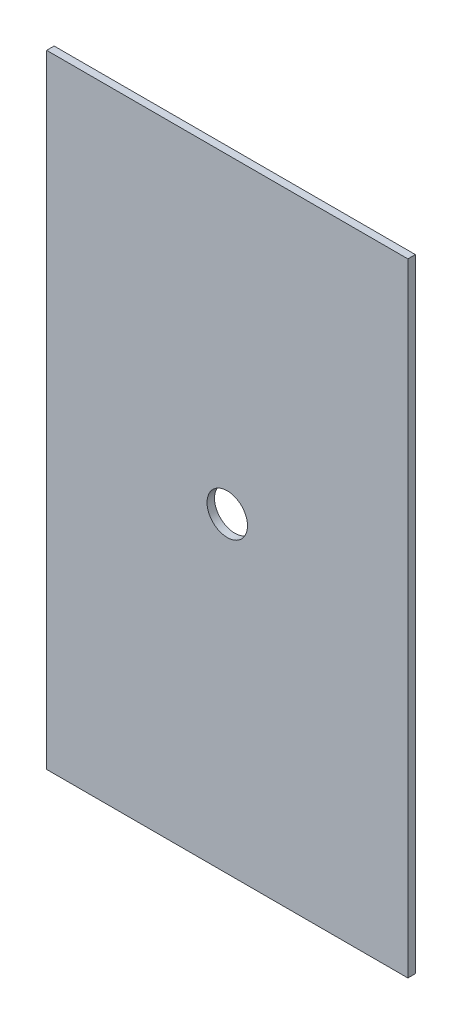
ISO-10303-21;
HEADER;
FILE_DESCRIPTION(('STEP AP214'),'2;1');
FILE_NAME('part.step','',(''),(''),'','','');
FILE_SCHEMA(('AUTOMOTIVE_DESIGN { 1 0 10303 214 1 1 1 1 }'));
ENDSEC;
DATA;
#1=APPLICATION_CONTEXT('core data for automotive mechanical design processes');
#2=APPLICATION_PROTOCOL_DEFINITION('international standard','automotive_design',2000,#1);
#3=PRODUCT_CONTEXT('',#1,'mechanical');
#4=PRODUCT('Part','Part','',(#3));
#5=PRODUCT_RELATED_PRODUCT_CATEGORY('part','',(#4));
#6=PRODUCT_DEFINITION_FORMATION('','',#4);
#7=PRODUCT_DEFINITION_CONTEXT('part definition',#1,'design');
#8=PRODUCT_DEFINITION('design','',#6,#7);
#9=PRODUCT_DEFINITION_SHAPE('','',#8);
#10=(LENGTH_UNIT() NAMED_UNIT(*) SI_UNIT(.MILLI.,.METRE.));
#11=(NAMED_UNIT(*) PLANE_ANGLE_UNIT() SI_UNIT($,.RADIAN.));
#12=(NAMED_UNIT(*) SI_UNIT($,.STERADIAN.) SOLID_ANGLE_UNIT());
#13=UNCERTAINTY_MEASURE_WITH_UNIT(LENGTH_MEASURE(1.E-05),#10,'distance_accuracy_value','');
#14=(GEOMETRIC_REPRESENTATION_CONTEXT(3) GLOBAL_UNCERTAINTY_ASSIGNED_CONTEXT((#13)) GLOBAL_UNIT_ASSIGNED_CONTEXT((#10,
#11,#12)) REPRESENTATION_CONTEXT('',''));
#15=CARTESIAN_POINT('',(0.,0.,0.));
#16=DIRECTION('',(0.,0.,1.));
#17=DIRECTION('',(1.,0.,0.));
#18=AXIS2_PLACEMENT_3D('',#15,#16,#17);
#19=CARTESIAN_POINT('',(-28.9999999999998,50.0000000000005,-1.20000000000053));
#20=DIRECTION('',(-0.999999999999999,0.,0.));
#21=DIRECTION('',(0.,-0.999999999999995,0.));
#22=AXIS2_PLACEMENT_3D('',#19,#20,#21);
#23=PLANE('',#22);
#24=DIRECTION('',(0.,-0.999999999999995,0.));
#25=VECTOR('',#24,1.);
#26=CARTESIAN_POINT('',(-28.9999999999998,50.000000000003,-9.29811783123569E-13));
#27=LINE('',#26,#25);
#28=CARTESIAN_POINT('',(-28.9999999999998,50.000000000003,-9.29811783123569E-13));
#29=VERTEX_POINT('',#28);
#30=CARTESIAN_POINT('',(-29.,-50.0000000000009,7.7715611723761E-13));
#31=VERTEX_POINT('',#30);
#32=EDGE_CURVE('E107',#29,#31,#27,.T.);
#33=ORIENTED_EDGE('',*,*,#32,.F.);
#34=DIRECTION('',(0.,0.,1.00000000000001));
#35=VECTOR('',#34,1.);
#36=CARTESIAN_POINT('',(-28.9999999999998,50.0000000000005,-1.20000000000053));
#37=LINE('',#36,#35);
#38=CARTESIAN_POINT('',(-28.9999999999998,50.0000000000005,-1.20000000000053));
#39=VERTEX_POINT('',#38);
#40=EDGE_CURVE('E12',#39,#29,#37,.T.);
#41=ORIENTED_EDGE('',*,*,#40,.F.);
#42=DIRECTION('',(0.,-0.999999999999995,0.));
#43=VECTOR('',#42,1.);
#44=CARTESIAN_POINT('',(-28.9999999999998,50.0000000000005,-1.20000000000053));
#45=LINE('',#44,#43);
#46=CARTESIAN_POINT('',(-29.0000000000002,-49.9999999999963,-1.1999999999992));
#47=VERTEX_POINT('',#46);
#48=EDGE_CURVE('E99',#39,#47,#45,.T.);
#49=ORIENTED_EDGE('',*,*,#48,.T.);
#50=DIRECTION('',(0.,0.,1.00000000000001));
#51=VECTOR('',#50,1.);
#52=CARTESIAN_POINT('',(-29.0000000000002,-49.9999999999963,-1.1999999999992));
#53=LINE('',#52,#51);
#54=EDGE_CURVE('E44',#47,#31,#53,.T.);
#55=ORIENTED_EDGE('',*,*,#54,.T.);
#56=EDGE_LOOP('',(#33,#41,#49,#55));
#57=FACE_BOUND('',#56,.T.);
#58=ADVANCED_FACE('F41',(#57),#23,.T.);
#59=CARTESIAN_POINT('',(29.0000000000001,49.9999999999996,-1.20000000000026));
#60=DIRECTION('',(0.,0.999999999999994,0.));
#61=DIRECTION('',(0.,0.,1.00000000000001));
#62=AXIS2_PLACEMENT_3D('',#59,#60,#61);
#63=PLANE('',#62);
#64=DIRECTION('',(-0.999999999999999,0.,0.));
#65=VECTOR('',#64,1.);
#66=CARTESIAN_POINT('',(29.0000000000002,50.0000000000032,1.66533453693773E-13));
#67=LINE('',#66,#65);
#68=CARTESIAN_POINT('',(29.0000000000002,50.0000000000032,1.66533453693773E-13));
#69=VERTEX_POINT('',#68);
#70=EDGE_CURVE('E101',#69,#29,#67,.T.);
#71=ORIENTED_EDGE('',*,*,#70,.F.);
#72=DIRECTION('',(0.,0.,1.00000000000001));
#73=VECTOR('',#72,1.);
#74=CARTESIAN_POINT('',(29.0000000000001,49.9999999999996,-1.20000000000026));
#75=LINE('',#74,#73);
#76=CARTESIAN_POINT('',(29.0000000000001,49.9999999999996,-1.20000000000026));
#77=VERTEX_POINT('',#76);
#78=EDGE_CURVE('E50',#77,#69,#75,.T.);
#79=ORIENTED_EDGE('',*,*,#78,.F.);
#80=DIRECTION('',(-0.999999999999999,0.,0.));
#81=VECTOR('',#80,1.);
#82=CARTESIAN_POINT('',(29.0000000000001,49.9999999999996,-1.20000000000026));
#83=LINE('',#82,#81);
#84=EDGE_CURVE('E96',#77,#39,#83,.T.);
#85=ORIENTED_EDGE('',*,*,#84,.T.);
#86=ORIENTED_EDGE('',*,*,#40,.T.);
#87=EDGE_LOOP('',(#71,#79,#85,#86));
#88=FACE_BOUND('',#87,.T.);
#89=ADVANCED_FACE('F118',(#88),#63,.T.);
#90=CARTESIAN_POINT('',(29.0000000000001,49.9999999999996,-1.20000000000026));
#91=DIRECTION('',(0.999999999999999,0.,0.));
#92=DIRECTION('',(0.,0.999999999999995,0.));
#93=AXIS2_PLACEMENT_3D('',#90,#91,#92);
#94=PLANE('',#93);
#95=DIRECTION('',(0.,0.999999999999995,0.));
#96=VECTOR('',#95,1.);
#97=CARTESIAN_POINT('',(29.0000000000002,50.0000000000032,1.66533453693773E-13));
#98=LINE('',#97,#96);
#99=CARTESIAN_POINT('',(28.9999999999999,-49.9999999999997,1.0547118733939E-12));
#100=VERTEX_POINT('',#99);
#101=EDGE_CURVE('E91',#100,#69,#98,.T.);
#102=ORIENTED_EDGE('',*,*,#101,.F.);
#103=DIRECTION('',(0.,0.,1.00000000000001));
#104=VECTOR('',#103,1.);
#105=CARTESIAN_POINT('',(28.9999999999998,-49.9999999999966,-1.1999999999982));
#106=LINE('',#105,#104);
#107=CARTESIAN_POINT('',(28.9999999999998,-49.9999999999966,-1.1999999999982));
#108=VERTEX_POINT('',#107);
#109=EDGE_CURVE('E86',#108,#100,#106,.T.);
#110=ORIENTED_EDGE('',*,*,#109,.F.);
#111=DIRECTION('',(0.,0.999999999999995,0.));
#112=VECTOR('',#111,1.);
#113=CARTESIAN_POINT('',(29.0000000000001,49.9999999999996,-1.20000000000026));
#114=LINE('',#113,#112);
#115=EDGE_CURVE('E89',#108,#77,#114,.T.);
#116=ORIENTED_EDGE('',*,*,#115,.T.);
#117=ORIENTED_EDGE('',*,*,#78,.T.);
#118=EDGE_LOOP('',(#102,#110,#116,#117));
#119=FACE_BOUND('',#118,.T.);
#120=ADVANCED_FACE('F88',(#119),#94,.T.);
#121=CARTESIAN_POINT('',(28.9999999999998,-49.9999999999966,-1.1999999999982));
#122=DIRECTION('',(0.,-0.999999999999995,0.));
#123=DIRECTION('',(0.999999999999999,0.,0.));
#124=AXIS2_PLACEMENT_3D('',#121,#122,#123);
#125=PLANE('',#124);
#126=DIRECTION('',(0.999999999999999,0.,0.));
#127=VECTOR('',#126,1.);
#128=CARTESIAN_POINT('',(28.9999999999999,-49.9999999999997,1.0547118733939E-12));
#129=LINE('',#128,#127);
#130=EDGE_CURVE('E110',#31,#100,#129,.T.);
#131=ORIENTED_EDGE('',*,*,#130,.F.);
#132=ORIENTED_EDGE('',*,*,#54,.F.);
#133=DIRECTION('',(0.999999999999999,0.,0.));
#134=VECTOR('',#133,1.);
#135=CARTESIAN_POINT('',(28.9999999999998,-49.9999999999966,-1.1999999999982));
#136=LINE('',#135,#134);
#137=EDGE_CURVE('E95',#47,#108,#136,.T.);
#138=ORIENTED_EDGE('',*,*,#137,.T.);
#139=ORIENTED_EDGE('',*,*,#109,.T.);
#140=EDGE_LOOP('',(#131,#132,#138,#139));
#141=FACE_BOUND('',#140,.T.);
#142=ADVANCED_FACE('F98',(#141),#125,.T.);
#143=CARTESIAN_POINT('',(0.,2.88657986402541E-12,-1.19999999999987));
#144=DIRECTION('',(0.,0.,-1.00000000000001));
#145=DIRECTION('',(-0.999999999999999,0.,0.));
#146=AXIS2_PLACEMENT_3D('',#143,#144,#145);
#147=PLANE('',#146);
#148=CARTESIAN_POINT('',(0.,2.88657986402541E-12,-1.19999999999987));
#149=DIRECTION('',(0.,0.,-1.00000000000001));
#150=DIRECTION('',(-0.999999999999999,0.,0.));
#151=AXIS2_PLACEMENT_3D('',#148,#149,#150);
#152=CIRCLE('',#151,3.25);
#153=CARTESIAN_POINT('',(-3.25,2.87537508850431E-12,-1.19999999999988));
#154=VERTEX_POINT('',#153);
#155=EDGE_CURVE('E146',#154,#154,#152,.F.);
#156=ORIENTED_EDGE('',*,*,#155,.T.);
#157=EDGE_LOOP('',(#156));
#158=FACE_BOUND('',#157,.T.);
#159=ORIENTED_EDGE('',*,*,#48,.F.);
#160=ORIENTED_EDGE('',*,*,#84,.F.);
#161=ORIENTED_EDGE('',*,*,#115,.F.);
#162=ORIENTED_EDGE('',*,*,#137,.F.);
#163=EDGE_LOOP('',(#159,#160,#161,#162));
#164=FACE_BOUND('',#163,.T.);
#165=ADVANCED_FACE('F94',(#158,#164),#147,.T.);
#166=CARTESIAN_POINT('',(0.,0.,0.));
#167=DIRECTION('',(0.,0.,-1.00000000000001));
#168=DIRECTION('',(-0.999999999999999,0.,0.));
#169=AXIS2_PLACEMENT_3D('',#166,#167,#168);
#170=PLANE('',#169);
#171=CARTESIAN_POINT('',(0.,0.,0.));
#172=DIRECTION('',(0.,0.,1.00000000000001));
#173=DIRECTION('',(0.999999999999999,0.,0.));
#174=AXIS2_PLACEMENT_3D('',#171,#172,#173);
#175=CIRCLE('',#174,3.25);
#176=CARTESIAN_POINT('',(3.25,0.,0.));
#177=VERTEX_POINT('',#176);
#178=EDGE_CURVE('E111',#177,#177,#175,.T.);
#179=ORIENTED_EDGE('',*,*,#178,.F.);
#180=EDGE_LOOP('',(#179));
#181=FACE_BOUND('',#180,.T.);
#182=ORIENTED_EDGE('',*,*,#32,.T.);
#183=ORIENTED_EDGE('',*,*,#130,.T.);
#184=ORIENTED_EDGE('',*,*,#101,.T.);
#185=ORIENTED_EDGE('',*,*,#70,.T.);
#186=EDGE_LOOP('',(#182,#183,#184,#185));
#187=FACE_BOUND('',#186,.T.);
#188=ADVANCED_FACE('F117',(#181,#187),#170,.F.);
#189=CARTESIAN_POINT('',(0.,3.5527136788005E-12,-1.20100000000001));
#190=DIRECTION('',(0.,0.,1.00000000000001));
#191=DIRECTION('',(0.999999999999999,0.,0.));
#192=AXIS2_PLACEMENT_3D('',#189,#190,#191);
#193=CYLINDRICAL_SURFACE('',#192,3.25);
#194=ORIENTED_EDGE('',*,*,#155,.F.);
#195=EDGE_LOOP('',(#194));
#196=FACE_BOUND('',#195,.T.);
#197=ORIENTED_EDGE('',*,*,#178,.T.);
#198=EDGE_LOOP('',(#197));
#199=FACE_BOUND('',#198,.T.);
#200=ADVANCED_FACE('F136',(#196,#199),#193,.F.);
#201=CLOSED_SHELL('',(#58,#89,#120,#142,#165,#188,#200));
#202=MANIFOLD_SOLID_BREP('B2',#201);
#203=ADVANCED_BREP_SHAPE_REPRESENTATION('',(#18,#202),#14);
#204=SHAPE_DEFINITION_REPRESENTATION(#9,#203);
ENDSEC;
END-ISO-10303-21;
